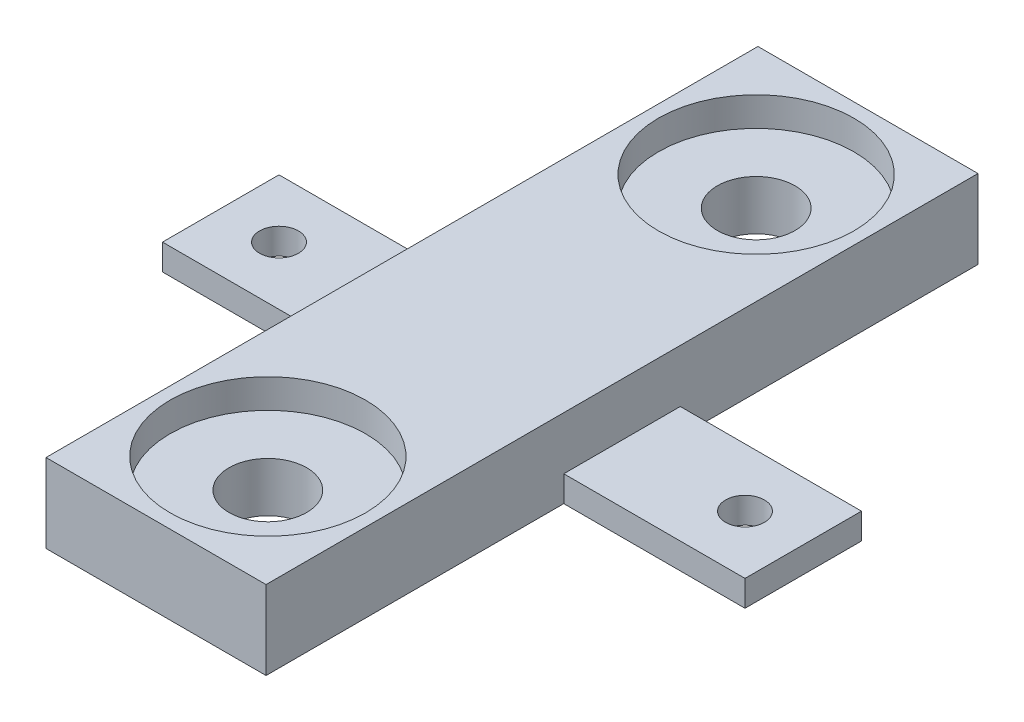
ISO-10303-21;
HEADER;
FILE_DESCRIPTION(('STEP AP214'),'2;1');
FILE_NAME('part.step','',(''),(''),'','','');
FILE_SCHEMA(('AUTOMOTIVE_DESIGN { 1 0 10303 214 1 1 1 1 }'));
ENDSEC;
DATA;
#1=APPLICATION_CONTEXT('core data for automotive mechanical design processes');
#2=APPLICATION_PROTOCOL_DEFINITION('international standard','automotive_design',2000,#1);
#3=PRODUCT_CONTEXT('',#1,'mechanical');
#4=PRODUCT('Part','Part','',(#3));
#5=PRODUCT_RELATED_PRODUCT_CATEGORY('part','',(#4));
#6=PRODUCT_DEFINITION_FORMATION('','',#4);
#7=PRODUCT_DEFINITION_CONTEXT('part definition',#1,'design');
#8=PRODUCT_DEFINITION('design','',#6,#7);
#9=PRODUCT_DEFINITION_SHAPE('','',#8);
#10=(LENGTH_UNIT() NAMED_UNIT(*) SI_UNIT(.MILLI.,.METRE.));
#11=(NAMED_UNIT(*) PLANE_ANGLE_UNIT() SI_UNIT($,.RADIAN.));
#12=(NAMED_UNIT(*) SI_UNIT($,.STERADIAN.) SOLID_ANGLE_UNIT());
#13=UNCERTAINTY_MEASURE_WITH_UNIT(LENGTH_MEASURE(1.E-05),#10,'distance_accuracy_value','');
#14=(GEOMETRIC_REPRESENTATION_CONTEXT(3) GLOBAL_UNCERTAINTY_ASSIGNED_CONTEXT((#13)) GLOBAL_UNIT_ASSIGNED_CONTEXT((#10,
#11,#12)) REPRESENTATION_CONTEXT('',''));
#15=CARTESIAN_POINT('',(0.,0.,0.));
#16=DIRECTION('',(0.,0.,1.));
#17=DIRECTION('',(1.,0.,0.));
#18=AXIS2_PLACEMENT_3D('',#15,#16,#17);
#19=CARTESIAN_POINT('',(0.,2.,0.));
#20=DIRECTION('',(0.,1.,0.));
#21=DIRECTION('',(0.,0.,1.));
#22=AXIS2_PLACEMENT_3D('',#19,#20,#21);
#23=PLANE('',#22);
#24=CARTESIAN_POINT('',(-18.,2.,0.));
#25=DIRECTION('',(0.,1.,0.));
#26=DIRECTION('',(0.,0.,1.));
#27=AXIS2_PLACEMENT_3D('',#24,#25,#26);
#28=CIRCLE('',#27,1.5);
#29=CARTESIAN_POINT('',(-18.,2.,1.5));
#30=VERTEX_POINT('',#29);
#31=EDGE_CURVE('E169',#30,#30,#28,.T.);
#32=ORIENTED_EDGE('',*,*,#31,.F.);
#33=EDGE_LOOP('',(#32));
#34=FACE_BOUND('',#33,.T.);
#35=DIRECTION('',(-1.,0.,0.));
#36=VECTOR('',#35,1.);
#37=CARTESIAN_POINT('',(0.,2.,4.49999999999999));
#38=LINE('',#37,#36);
#39=CARTESIAN_POINT('',(-8.5,2.,4.5));
#40=VERTEX_POINT('',#39);
#41=CARTESIAN_POINT('',(-22.5,2.,4.5));
#42=VERTEX_POINT('',#41);
#43=EDGE_CURVE('E155',#40,#42,#38,.T.);
#44=ORIENTED_EDGE('',*,*,#43,.F.);
#45=DIRECTION('',(0.,0.,-1.));
#46=VECTOR('',#45,1.);
#47=CARTESIAN_POINT('',(-8.5,2.,0.));
#48=LINE('',#47,#46);
#49=CARTESIAN_POINT('',(-8.5,2.,-4.5));
#50=VERTEX_POINT('',#49);
#51=EDGE_CURVE('E255',#40,#50,#48,.T.);
#52=ORIENTED_EDGE('',*,*,#51,.T.);
#53=DIRECTION('',(-1.,0.,0.));
#54=VECTOR('',#53,1.);
#55=CARTESIAN_POINT('',(0.,2.,-4.49999999999999));
#56=LINE('',#55,#54);
#57=CARTESIAN_POINT('',(-22.5,2.,-4.5));
#58=VERTEX_POINT('',#57);
#59=EDGE_CURVE('E138',#50,#58,#56,.T.);
#60=ORIENTED_EDGE('',*,*,#59,.T.);
#61=DIRECTION('',(0.,0.,1.));
#62=VECTOR('',#61,1.);
#63=CARTESIAN_POINT('',(-22.5,2.,0.));
#64=LINE('',#63,#62);
#65=EDGE_CURVE('E269',#58,#42,#64,.T.);
#66=ORIENTED_EDGE('',*,*,#65,.T.);
#67=EDGE_LOOP('',(#44,#52,#60,#66));
#68=FACE_BOUND('',#67,.T.);
#69=ADVANCED_FACE('F64',(#34,#68),#23,.T.);
#70=CARTESIAN_POINT('',(0.,2.,-27.5));
#71=DIRECTION('',(0.,0.,-1.));
#72=DIRECTION('',(-1.,0.,0.));
#73=AXIS2_PLACEMENT_3D('',#70,#71,#72);
#74=PLANE('',#73);
#75=DIRECTION('',(1.,0.,0.));
#76=VECTOR('',#75,1.);
#77=CARTESIAN_POINT('',(0.,0.,-27.5));
#78=LINE('',#77,#76);
#79=CARTESIAN_POINT('',(-8.5,0.,-27.5));
#80=VERTEX_POINT('',#79);
#81=CARTESIAN_POINT('',(8.5,0.,-27.5));
#82=VERTEX_POINT('',#81);
#83=EDGE_CURVE('E180',#80,#82,#78,.T.);
#84=ORIENTED_EDGE('',*,*,#83,.F.);
#85=DIRECTION('',(0.,-1.,0.));
#86=VECTOR('',#85,1.);
#87=CARTESIAN_POINT('',(-8.5,2.,-27.5));
#88=LINE('',#87,#86);
#89=CARTESIAN_POINT('',(-8.5,6.088,-27.5));
#90=VERTEX_POINT('',#89);
#91=EDGE_CURVE('E229',#90,#80,#88,.T.);
#92=ORIENTED_EDGE('',*,*,#91,.F.);
#93=DIRECTION('',(1.,0.,0.));
#94=VECTOR('',#93,1.);
#95=CARTESIAN_POINT('',(0.,6.088,-27.5));
#96=LINE('',#95,#94);
#97=CARTESIAN_POINT('',(8.5,6.088,-27.5));
#98=VERTEX_POINT('',#97);
#99=EDGE_CURVE('E261',#90,#98,#96,.T.);
#100=ORIENTED_EDGE('',*,*,#99,.T.);
#101=DIRECTION('',(0.,-1.,0.));
#102=VECTOR('',#101,1.);
#103=CARTESIAN_POINT('',(8.5,2.,-27.5));
#104=LINE('',#103,#102);
#105=EDGE_CURVE('E231',#98,#82,#104,.T.);
#106=ORIENTED_EDGE('',*,*,#105,.T.);
#107=EDGE_LOOP('',(#84,#92,#100,#106));
#108=FACE_BOUND('',#107,.T.);
#109=ADVANCED_FACE('F66',(#108),#74,.T.);
#110=CARTESIAN_POINT('',(0.,2.,-4.49999999999999));
#111=DIRECTION('',(0.,0.,1.));
#112=DIRECTION('',(1.,0.,0.));
#113=AXIS2_PLACEMENT_3D('',#110,#111,#112);
#114=PLANE('',#113);
#115=DIRECTION('',(-1.,0.,0.));
#116=VECTOR('',#115,1.);
#117=CARTESIAN_POINT('',(0.,0.,-4.49999999999999));
#118=LINE('',#117,#116);
#119=CARTESIAN_POINT('',(-8.5,0.,-4.5));
#120=VERTEX_POINT('',#119);
#121=CARTESIAN_POINT('',(-22.5,0.,-4.5));
#122=VERTEX_POINT('',#121);
#123=EDGE_CURVE('E187',#120,#122,#118,.T.);
#124=ORIENTED_EDGE('',*,*,#123,.T.);
#125=DIRECTION('',(0.,-1.,0.));
#126=VECTOR('',#125,1.);
#127=CARTESIAN_POINT('',(-22.5,2.,-4.5));
#128=LINE('',#127,#126);
#129=EDGE_CURVE('E223',#58,#122,#128,.T.);
#130=ORIENTED_EDGE('',*,*,#129,.F.);
#131=ORIENTED_EDGE('',*,*,#59,.F.);
#132=DIRECTION('',(0.,-1.,0.));
#133=VECTOR('',#132,1.);
#134=CARTESIAN_POINT('',(-8.5,2.,-4.5));
#135=LINE('',#134,#133);
#136=EDGE_CURVE('E226',#50,#120,#135,.T.);
#137=ORIENTED_EDGE('',*,*,#136,.T.);
#138=EDGE_LOOP('',(#124,#130,#131,#137));
#139=FACE_BOUND('',#138,.T.);
#140=ADVANCED_FACE('F336',(#139),#114,.F.);
#141=CARTESIAN_POINT('',(-22.5,2.,0.));
#142=DIRECTION('',(1.,0.,0.));
#143=DIRECTION('',(0.,0.,-1.));
#144=AXIS2_PLACEMENT_3D('',#141,#142,#143);
#145=PLANE('',#144);
#146=DIRECTION('',(0.,0.,1.));
#147=VECTOR('',#146,1.);
#148=CARTESIAN_POINT('',(-22.5,0.,0.));
#149=LINE('',#148,#147);
#150=CARTESIAN_POINT('',(-22.5,0.,4.5));
#151=VERTEX_POINT('',#150);
#152=EDGE_CURVE('E190',#122,#151,#149,.T.);
#153=ORIENTED_EDGE('',*,*,#152,.T.);
#154=DIRECTION('',(0.,-1.,0.));
#155=VECTOR('',#154,1.);
#156=CARTESIAN_POINT('',(-22.5,2.,4.5));
#157=LINE('',#156,#155);
#158=EDGE_CURVE('E221',#42,#151,#157,.T.);
#159=ORIENTED_EDGE('',*,*,#158,.F.);
#160=ORIENTED_EDGE('',*,*,#65,.F.);
#161=ORIENTED_EDGE('',*,*,#129,.T.);
#162=EDGE_LOOP('',(#153,#159,#160,#161));
#163=FACE_BOUND('',#162,.T.);
#164=ADVANCED_FACE('F490',(#163),#145,.F.);
#165=CARTESIAN_POINT('',(0.,2.,4.49999999999999));
#166=DIRECTION('',(0.,0.,1.));
#167=DIRECTION('',(1.,0.,0.));
#168=AXIS2_PLACEMENT_3D('',#165,#166,#167);
#169=PLANE('',#168);
#170=DIRECTION('',(-1.,0.,0.));
#171=VECTOR('',#170,1.);
#172=CARTESIAN_POINT('',(0.,0.,4.49999999999999));
#173=LINE('',#172,#171);
#174=CARTESIAN_POINT('',(-8.5,0.,4.49999999999999));
#175=VERTEX_POINT('',#174);
#176=EDGE_CURVE('E193',#175,#151,#173,.T.);
#177=ORIENTED_EDGE('',*,*,#176,.F.);
#178=DIRECTION('',(0.,-1.,0.));
#179=VECTOR('',#178,1.);
#180=CARTESIAN_POINT('',(-8.5,2.,4.49999999999999));
#181=LINE('',#180,#179);
#182=EDGE_CURVE('E219',#40,#175,#181,.T.);
#183=ORIENTED_EDGE('',*,*,#182,.F.);
#184=ORIENTED_EDGE('',*,*,#43,.T.);
#185=ORIENTED_EDGE('',*,*,#158,.T.);
#186=EDGE_LOOP('',(#177,#183,#184,#185));
#187=FACE_BOUND('',#186,.T.);
#188=ADVANCED_FACE('F275',(#187),#169,.T.);
#189=CARTESIAN_POINT('',(-8.5,2.,0.));
#190=DIRECTION('',(1.,0.,0.));
#191=DIRECTION('',(0.,0.,-1.));
#192=AXIS2_PLACEMENT_3D('',#189,#190,#191);
#193=PLANE('',#192);
#194=DIRECTION('',(0.,0.,1.));
#195=VECTOR('',#194,1.);
#196=CARTESIAN_POINT('',(-8.5,0.,0.));
#197=LINE('',#196,#195);
#198=CARTESIAN_POINT('',(-8.49999999999999,0.,27.5));
#199=VERTEX_POINT('',#198);
#200=EDGE_CURVE('E188',#175,#199,#197,.T.);
#201=ORIENTED_EDGE('',*,*,#200,.T.);
#202=DIRECTION('',(0.,-1.,0.));
#203=VECTOR('',#202,1.);
#204=CARTESIAN_POINT('',(-8.49999999999999,2.,27.5));
#205=LINE('',#204,#203);
#206=CARTESIAN_POINT('',(-8.49999999999999,6.088,27.5));
#207=VERTEX_POINT('',#206);
#208=EDGE_CURVE('E216',#207,#199,#205,.T.);
#209=ORIENTED_EDGE('',*,*,#208,.F.);
#210=DIRECTION('',(0.,0.,1.));
#211=VECTOR('',#210,1.);
#212=CARTESIAN_POINT('',(-8.5,6.088,0.));
#213=LINE('',#212,#211);
#214=EDGE_CURVE('E181',#90,#207,#213,.T.);
#215=ORIENTED_EDGE('',*,*,#214,.F.);
#216=ORIENTED_EDGE('',*,*,#91,.T.);
#217=EDGE_CURVE('E185',#80,#120,#197,.T.);
#218=ORIENTED_EDGE('',*,*,#217,.T.);
#219=ORIENTED_EDGE('',*,*,#136,.F.);
#220=ORIENTED_EDGE('',*,*,#51,.F.);
#221=ORIENTED_EDGE('',*,*,#182,.T.);
#222=EDGE_LOOP('',(#201,#209,#215,#216,#218,#219,#220,#221));
#223=FACE_BOUND('',#222,.T.);
#224=ADVANCED_FACE('F311',(#223),#193,.F.);
#225=CARTESIAN_POINT('',(0.,2.,27.5));
#226=DIRECTION('',(0.,0.,-1.));
#227=DIRECTION('',(-1.,0.,0.));
#228=AXIS2_PLACEMENT_3D('',#225,#226,#227);
#229=PLANE('',#228);
#230=DIRECTION('',(1.,0.,0.));
#231=VECTOR('',#230,1.);
#232=CARTESIAN_POINT('',(0.,0.,27.5));
#233=LINE('',#232,#231);
#234=CARTESIAN_POINT('',(8.5,0.,27.5));
#235=VERTEX_POINT('',#234);
#236=EDGE_CURVE('E196',#199,#235,#233,.T.);
#237=ORIENTED_EDGE('',*,*,#236,.T.);
#238=DIRECTION('',(0.,-1.,0.));
#239=VECTOR('',#238,1.);
#240=CARTESIAN_POINT('',(8.5,2.,27.5));
#241=LINE('',#240,#239);
#242=CARTESIAN_POINT('',(8.5,6.088,27.5));
#243=VERTEX_POINT('',#242);
#244=EDGE_CURVE('E214',#243,#235,#241,.T.);
#245=ORIENTED_EDGE('',*,*,#244,.F.);
#246=DIRECTION('',(1.,0.,0.));
#247=VECTOR('',#246,1.);
#248=CARTESIAN_POINT('',(0.,6.088,27.5));
#249=LINE('',#248,#247);
#250=EDGE_CURVE('E252',#207,#243,#249,.T.);
#251=ORIENTED_EDGE('',*,*,#250,.F.);
#252=ORIENTED_EDGE('',*,*,#208,.T.);
#253=EDGE_LOOP('',(#237,#245,#251,#252));
#254=FACE_BOUND('',#253,.T.);
#255=ADVANCED_FACE('F298',(#254),#229,.F.);
#256=CARTESIAN_POINT('',(8.5,2.,0.));
#257=DIRECTION('',(1.,0.,0.));
#258=DIRECTION('',(0.,0.,-1.));
#259=AXIS2_PLACEMENT_3D('',#256,#257,#258);
#260=PLANE('',#259);
#261=DIRECTION('',(0.,0.,1.));
#262=VECTOR('',#261,1.);
#263=CARTESIAN_POINT('',(8.5,0.,0.));
#264=LINE('',#263,#262);
#265=CARTESIAN_POINT('',(8.5,0.,4.5));
#266=VERTEX_POINT('',#265);
#267=EDGE_CURVE('E182',#266,#235,#264,.T.);
#268=ORIENTED_EDGE('',*,*,#267,.F.);
#269=DIRECTION('',(0.,-1.,0.));
#270=VECTOR('',#269,1.);
#271=CARTESIAN_POINT('',(8.5,2.,4.5));
#272=LINE('',#271,#270);
#273=CARTESIAN_POINT('',(8.5,2.,4.49999999999999));
#274=VERTEX_POINT('',#273);
#275=EDGE_CURVE('E164',#274,#266,#272,.T.);
#276=ORIENTED_EDGE('',*,*,#275,.F.);
#277=DIRECTION('',(0.,0.,-1.));
#278=VECTOR('',#277,1.);
#279=CARTESIAN_POINT('',(8.5,2.,0.));
#280=LINE('',#279,#278);
#281=CARTESIAN_POINT('',(8.5,2.,-4.5));
#282=VERTEX_POINT('',#281);
#283=EDGE_CURVE('E83',#274,#282,#280,.T.);
#284=ORIENTED_EDGE('',*,*,#283,.T.);
#285=DIRECTION('',(0.,-1.,0.));
#286=VECTOR('',#285,1.);
#287=CARTESIAN_POINT('',(8.5,2.,-4.5));
#288=LINE('',#287,#286);
#289=CARTESIAN_POINT('',(8.5,0.,-4.5));
#290=VERTEX_POINT('',#289);
#291=EDGE_CURVE('E129',#282,#290,#288,.T.);
#292=ORIENTED_EDGE('',*,*,#291,.T.);
#293=EDGE_CURVE('E178',#82,#290,#264,.T.);
#294=ORIENTED_EDGE('',*,*,#293,.F.);
#295=ORIENTED_EDGE('',*,*,#105,.F.);
#296=DIRECTION('',(0.,0.,1.));
#297=VECTOR('',#296,1.);
#298=CARTESIAN_POINT('',(8.5,6.088,0.));
#299=LINE('',#298,#297);
#300=EDGE_CURVE('E258',#98,#243,#299,.T.);
#301=ORIENTED_EDGE('',*,*,#300,.T.);
#302=ORIENTED_EDGE('',*,*,#244,.T.);
#303=EDGE_LOOP('',(#268,#276,#284,#292,#294,#295,#301,#302));
#304=FACE_BOUND('',#303,.T.);
#305=ADVANCED_FACE('F307',(#304),#260,.T.);
#306=CARTESIAN_POINT('',(0.,2.,4.5));
#307=DIRECTION('',(0.,0.,-1.));
#308=DIRECTION('',(-1.,0.,0.));
#309=AXIS2_PLACEMENT_3D('',#306,#307,#308);
#310=PLANE('',#309);
#311=DIRECTION('',(1.,0.,0.));
#312=VECTOR('',#311,1.);
#313=CARTESIAN_POINT('',(0.,0.,4.5));
#314=LINE('',#313,#312);
#315=CARTESIAN_POINT('',(22.5,0.,4.49999999999999));
#316=VERTEX_POINT('',#315);
#317=EDGE_CURVE('E161',#266,#316,#314,.T.);
#318=ORIENTED_EDGE('',*,*,#317,.T.);
#319=DIRECTION('',(0.,-1.,0.));
#320=VECTOR('',#319,1.);
#321=CARTESIAN_POINT('',(22.5,2.,4.49999999999999));
#322=LINE('',#321,#320);
#323=CARTESIAN_POINT('',(22.5,2.,4.49999999999999));
#324=VERTEX_POINT('',#323);
#325=EDGE_CURVE('E158',#324,#316,#322,.T.);
#326=ORIENTED_EDGE('',*,*,#325,.F.);
#327=DIRECTION('',(1.,0.,0.));
#328=VECTOR('',#327,1.);
#329=CARTESIAN_POINT('',(0.,2.,4.5));
#330=LINE('',#329,#328);
#331=EDGE_CURVE('E147',#274,#324,#330,.T.);
#332=ORIENTED_EDGE('',*,*,#331,.F.);
#333=ORIENTED_EDGE('',*,*,#275,.T.);
#334=EDGE_LOOP('',(#318,#326,#332,#333));
#335=FACE_BOUND('',#334,.T.);
#336=ADVANCED_FACE('F159',(#335),#310,.F.);
#337=CARTESIAN_POINT('',(22.5,2.,0.));
#338=DIRECTION('',(1.,0.,0.));
#339=DIRECTION('',(0.,0.,-1.));
#340=AXIS2_PLACEMENT_3D('',#337,#338,#339);
#341=PLANE('',#340);
#342=DIRECTION('',(0.,0.,1.));
#343=VECTOR('',#342,1.);
#344=CARTESIAN_POINT('',(22.5,0.,0.));
#345=LINE('',#344,#343);
#346=CARTESIAN_POINT('',(22.5,0.,-4.50000000000001));
#347=VERTEX_POINT('',#346);
#348=EDGE_CURVE('E200',#347,#316,#345,.T.);
#349=ORIENTED_EDGE('',*,*,#348,.F.);
#350=DIRECTION('',(0.,-1.,0.));
#351=VECTOR('',#350,1.);
#352=CARTESIAN_POINT('',(22.5,2.,-4.50000000000001));
#353=LINE('',#352,#351);
#354=CARTESIAN_POINT('',(22.5,2.,-4.50000000000001));
#355=VERTEX_POINT('',#354);
#356=EDGE_CURVE('E125',#355,#347,#353,.T.);
#357=ORIENTED_EDGE('',*,*,#356,.F.);
#358=DIRECTION('',(0.,0.,1.));
#359=VECTOR('',#358,1.);
#360=CARTESIAN_POINT('',(22.5,2.,0.));
#361=LINE('',#360,#359);
#362=EDGE_CURVE('E153',#355,#324,#361,.T.);
#363=ORIENTED_EDGE('',*,*,#362,.T.);
#364=ORIENTED_EDGE('',*,*,#325,.T.);
#365=EDGE_LOOP('',(#349,#357,#363,#364));
#366=FACE_BOUND('',#365,.T.);
#367=ADVANCED_FACE('F166',(#366),#341,.T.);
#368=CARTESIAN_POINT('',(-18.,2.,0.));
#369=DIRECTION('',(0.,-1.,0.));
#370=DIRECTION('',(0.,0.,-1.));
#371=AXIS2_PLACEMENT_3D('',#368,#369,#370);
#372=CYLINDRICAL_SURFACE('',#371,1.5);
#373=ORIENTED_EDGE('',*,*,#31,.T.);
#374=EDGE_LOOP('',(#373));
#375=FACE_BOUND('',#374,.T.);
#376=CARTESIAN_POINT('',(-18.,0.,0.));
#377=DIRECTION('',(0.,1.,0.));
#378=DIRECTION('',(0.,0.,1.));
#379=AXIS2_PLACEMENT_3D('',#376,#377,#378);
#380=CIRCLE('',#379,1.5);
#381=CARTESIAN_POINT('',(-18.,0.,1.5));
#382=VERTEX_POINT('',#381);
#383=EDGE_CURVE('E205',#382,#382,#380,.T.);
#384=ORIENTED_EDGE('',*,*,#383,.F.);
#385=EDGE_LOOP('',(#384));
#386=FACE_BOUND('',#385,.T.);
#387=ADVANCED_FACE('F319',(#375,#386),#372,.F.);
#388=CARTESIAN_POINT('',(0.,2.,-4.49999999999999));
#389=DIRECTION('',(0.,0.,-1.));
#390=DIRECTION('',(-1.,0.,0.));
#391=AXIS2_PLACEMENT_3D('',#388,#389,#390);
#392=PLANE('',#391);
#393=DIRECTION('',(1.,0.,0.));
#394=VECTOR('',#393,1.);
#395=CARTESIAN_POINT('',(0.,0.,-4.49999999999999));
#396=LINE('',#395,#394);
#397=EDGE_CURVE('E202',#290,#347,#396,.T.);
#398=ORIENTED_EDGE('',*,*,#397,.F.);
#399=ORIENTED_EDGE('',*,*,#291,.F.);
#400=DIRECTION('',(1.,0.,0.));
#401=VECTOR('',#400,1.);
#402=CARTESIAN_POINT('',(0.,2.,-4.49999999999999));
#403=LINE('',#402,#401);
#404=EDGE_CURVE('E167',#282,#355,#403,.T.);
#405=ORIENTED_EDGE('',*,*,#404,.T.);
#406=ORIENTED_EDGE('',*,*,#356,.T.);
#407=EDGE_LOOP('',(#398,#399,#405,#406));
#408=FACE_BOUND('',#407,.T.);
#409=ADVANCED_FACE('F316',(#408),#392,.T.);
#410=CARTESIAN_POINT('',(18.,2.,0.));
#411=DIRECTION('',(0.,-1.,0.));
#412=DIRECTION('',(0.,0.,-1.));
#413=AXIS2_PLACEMENT_3D('',#410,#411,#412);
#414=CYLINDRICAL_SURFACE('',#413,1.5);
#415=CARTESIAN_POINT('',(18.,2.,0.));
#416=DIRECTION('',(0.,1.,0.));
#417=DIRECTION('',(0.,0.,1.));
#418=AXIS2_PLACEMENT_3D('',#415,#416,#417);
#419=CIRCLE('',#418,1.5);
#420=CARTESIAN_POINT('',(18.,2.,1.49999999999999));
#421=VERTEX_POINT('',#420);
#422=EDGE_CURVE('E175',#421,#421,#419,.T.);
#423=ORIENTED_EDGE('',*,*,#422,.T.);
#424=EDGE_LOOP('',(#423));
#425=FACE_BOUND('',#424,.T.);
#426=CARTESIAN_POINT('',(18.,0.,0.));
#427=DIRECTION('',(0.,1.,0.));
#428=DIRECTION('',(0.,0.,1.));
#429=AXIS2_PLACEMENT_3D('',#426,#427,#428);
#430=CIRCLE('',#429,1.5);
#431=CARTESIAN_POINT('',(18.,0.,1.49999999999999));
#432=VERTEX_POINT('',#431);
#433=EDGE_CURVE('E208',#432,#432,#430,.T.);
#434=ORIENTED_EDGE('',*,*,#433,.F.);
#435=EDGE_LOOP('',(#434));
#436=FACE_BOUND('',#435,.T.);
#437=ADVANCED_FACE('F318',(#425,#436),#414,.F.);
#438=ORIENTED_EDGE('',*,*,#283,.F.);
#439=ORIENTED_EDGE('',*,*,#331,.T.);
#440=ORIENTED_EDGE('',*,*,#362,.F.);
#441=ORIENTED_EDGE('',*,*,#404,.F.);
#442=EDGE_LOOP('',(#438,#439,#440,#441));
#443=FACE_BOUND('',#442,.T.);
#444=ORIENTED_EDGE('',*,*,#422,.F.);
#445=EDGE_LOOP('',(#444));
#446=FACE_BOUND('',#445,.T.);
#447=ADVANCED_FACE('F149',(#443,#446),#23,.T.);
#448=CARTESIAN_POINT('',(0.,0.,0.));
#449=DIRECTION('',(0.,1.,0.));
#450=DIRECTION('',(0.,0.,1.));
#451=AXIS2_PLACEMENT_3D('',#448,#449,#450);
#452=PLANE('',#451);
#453=CARTESIAN_POINT('',(0.,0.,-18.8625));
#454=DIRECTION('',(0.,-1.,0.));
#455=DIRECTION('',(0.,0.,-1.));
#456=AXIS2_PLACEMENT_3D('',#453,#454,#455);
#457=CIRCLE('',#456,3.);
#458=CARTESIAN_POINT('',(0.,0.,-21.8625));
#459=VERTEX_POINT('',#458);
#460=EDGE_CURVE('E234',#459,#459,#457,.T.);
#461=ORIENTED_EDGE('',*,*,#460,.F.);
#462=EDGE_LOOP('',(#461));
#463=FACE_BOUND('',#462,.T.);
#464=CARTESIAN_POINT('',(0.,0.,18.8625));
#465=DIRECTION('',(0.,-1.,0.));
#466=DIRECTION('',(0.,0.,-1.));
#467=AXIS2_PLACEMENT_3D('',#464,#465,#466);
#468=CIRCLE('',#467,3.);
#469=CARTESIAN_POINT('',(0.,0.,15.8625));
#470=VERTEX_POINT('',#469);
#471=EDGE_CURVE('E240',#470,#470,#468,.T.);
#472=ORIENTED_EDGE('',*,*,#471,.F.);
#473=EDGE_LOOP('',(#472));
#474=FACE_BOUND('',#473,.T.);
#475=ORIENTED_EDGE('',*,*,#293,.T.);
#476=ORIENTED_EDGE('',*,*,#397,.T.);
#477=ORIENTED_EDGE('',*,*,#348,.T.);
#478=ORIENTED_EDGE('',*,*,#317,.F.);
#479=ORIENTED_EDGE('',*,*,#267,.T.);
#480=ORIENTED_EDGE('',*,*,#236,.F.);
#481=ORIENTED_EDGE('',*,*,#200,.F.);
#482=ORIENTED_EDGE('',*,*,#176,.T.);
#483=ORIENTED_EDGE('',*,*,#152,.F.);
#484=ORIENTED_EDGE('',*,*,#123,.F.);
#485=ORIENTED_EDGE('',*,*,#217,.F.);
#486=ORIENTED_EDGE('',*,*,#83,.T.);
#487=EDGE_LOOP('',(#475,#476,#477,#478,#479,#480,#481,#482,#483,#484,#485,#486));
#488=FACE_BOUND('',#487,.T.);
#489=ORIENTED_EDGE('',*,*,#383,.T.);
#490=EDGE_LOOP('',(#489));
#491=FACE_BOUND('',#490,.T.);
#492=ORIENTED_EDGE('',*,*,#433,.T.);
#493=EDGE_LOOP('',(#492));
#494=FACE_BOUND('',#493,.T.);
#495=ADVANCED_FACE('F314',(#463,#474,#488,#491,#494),#452,.F.);
#496=CARTESIAN_POINT('',(0.,6.088,0.));
#497=DIRECTION('',(0.,-1.,0.));
#498=DIRECTION('',(0.,0.,-1.));
#499=AXIS2_PLACEMENT_3D('',#496,#497,#498);
#500=PLANE('',#499);
#501=CARTESIAN_POINT('',(0.,6.088,18.8625));
#502=DIRECTION('',(0.,-1.,0.));
#503=DIRECTION('',(0.,0.,-1.));
#504=AXIS2_PLACEMENT_3D('',#501,#502,#503);
#505=CIRCLE('',#504,7.55);
#506=CARTESIAN_POINT('',(0.,6.088,11.3125));
#507=VERTEX_POINT('',#506);
#508=EDGE_CURVE('E238',#507,#507,#505,.T.);
#509=ORIENTED_EDGE('',*,*,#508,.T.);
#510=EDGE_LOOP('',(#509));
#511=FACE_BOUND('',#510,.T.);
#512=CARTESIAN_POINT('',(0.,6.088,-18.8625));
#513=DIRECTION('',(0.,-1.,0.));
#514=DIRECTION('',(0.,0.,-1.));
#515=AXIS2_PLACEMENT_3D('',#512,#513,#514);
#516=CIRCLE('',#515,7.55);
#517=CARTESIAN_POINT('',(0.,6.088,-26.4125));
#518=VERTEX_POINT('',#517);
#519=EDGE_CURVE('E248',#518,#518,#516,.T.);
#520=ORIENTED_EDGE('',*,*,#519,.T.);
#521=EDGE_LOOP('',(#520));
#522=FACE_BOUND('',#521,.T.);
#523=ORIENTED_EDGE('',*,*,#250,.T.);
#524=ORIENTED_EDGE('',*,*,#300,.F.);
#525=ORIENTED_EDGE('',*,*,#99,.F.);
#526=ORIENTED_EDGE('',*,*,#214,.T.);
#527=EDGE_LOOP('',(#523,#524,#525,#526));
#528=FACE_BOUND('',#527,.T.);
#529=ADVANCED_FACE('F304',(#511,#522,#528),#500,.F.);
#530=CARTESIAN_POINT('',(0.,6.088,-18.8625));
#531=DIRECTION('',(0.,-1.,0.));
#532=DIRECTION('',(0.,0.,-1.));
#533=AXIS2_PLACEMENT_3D('',#530,#531,#532);
#534=CYLINDRICAL_SURFACE('',#533,7.55);
#535=ORIENTED_EDGE('',*,*,#519,.F.);
#536=EDGE_LOOP('',(#535));
#537=FACE_BOUND('',#536,.T.);
#538=CARTESIAN_POINT('',(0.,3.838,-18.8625));
#539=DIRECTION('',(0.,-1.,0.));
#540=DIRECTION('',(0.,0.,-1.));
#541=AXIS2_PLACEMENT_3D('',#538,#539,#540);
#542=CIRCLE('',#541,7.55);
#543=CARTESIAN_POINT('',(0.,3.838,-26.4125));
#544=VERTEX_POINT('',#543);
#545=EDGE_CURVE('E74',#544,#544,#542,.T.);
#546=ORIENTED_EDGE('',*,*,#545,.T.);
#547=EDGE_LOOP('',(#546));
#548=FACE_BOUND('',#547,.T.);
#549=ADVANCED_FACE('F348',(#537,#548),#534,.F.);
#550=CARTESIAN_POINT('',(0.,6.088,18.8625));
#551=DIRECTION('',(0.,-1.,0.));
#552=DIRECTION('',(0.,0.,-1.));
#553=AXIS2_PLACEMENT_3D('',#550,#551,#552);
#554=CYLINDRICAL_SURFACE('',#553,7.55);
#555=ORIENTED_EDGE('',*,*,#508,.F.);
#556=EDGE_LOOP('',(#555));
#557=FACE_BOUND('',#556,.T.);
#558=CARTESIAN_POINT('',(0.,3.838,18.8625));
#559=DIRECTION('',(0.,-1.,0.));
#560=DIRECTION('',(0.,0.,-1.));
#561=AXIS2_PLACEMENT_3D('',#558,#559,#560);
#562=CIRCLE('',#561,7.55);
#563=CARTESIAN_POINT('',(0.,3.838,11.3125));
#564=VERTEX_POINT('',#563);
#565=EDGE_CURVE('E12',#564,#564,#562,.T.);
#566=ORIENTED_EDGE('',*,*,#565,.T.);
#567=EDGE_LOOP('',(#566));
#568=FACE_BOUND('',#567,.T.);
#569=ADVANCED_FACE('F367',(#557,#568),#554,.F.);
#570=CARTESIAN_POINT('',(0.,3.838,0.));
#571=DIRECTION('',(0.,-1.,0.));
#572=DIRECTION('',(0.,0.,-1.));
#573=AXIS2_PLACEMENT_3D('',#570,#571,#572);
#574=PLANE('',#573);
#575=CARTESIAN_POINT('',(0.,3.838,-18.8625));
#576=DIRECTION('',(0.,-1.,0.));
#577=DIRECTION('',(0.,0.,-1.));
#578=AXIS2_PLACEMENT_3D('',#575,#576,#577);
#579=CIRCLE('',#578,3.);
#580=CARTESIAN_POINT('',(0.,3.838,-21.8625));
#581=VERTEX_POINT('',#580);
#582=EDGE_CURVE('E68',#581,#581,#579,.T.);
#583=ORIENTED_EDGE('',*,*,#582,.T.);
#584=EDGE_LOOP('',(#583));
#585=FACE_BOUND('',#584,.T.);
#586=ORIENTED_EDGE('',*,*,#545,.F.);
#587=EDGE_LOOP('',(#586));
#588=FACE_BOUND('',#587,.T.);
#589=ADVANCED_FACE('F365',(#585,#588),#574,.F.);
#590=CARTESIAN_POINT('',(0.,3.838,18.8625));
#591=DIRECTION('',(0.,-1.,0.));
#592=DIRECTION('',(0.,0.,-1.));
#593=AXIS2_PLACEMENT_3D('',#590,#591,#592);
#594=CIRCLE('',#593,3.);
#595=CARTESIAN_POINT('',(0.,3.838,15.8625));
#596=VERTEX_POINT('',#595);
#597=EDGE_CURVE('E232',#596,#596,#594,.T.);
#598=ORIENTED_EDGE('',*,*,#597,.T.);
#599=EDGE_LOOP('',(#598));
#600=FACE_BOUND('',#599,.T.);
#601=ORIENTED_EDGE('',*,*,#565,.F.);
#602=EDGE_LOOP('',(#601));
#603=FACE_BOUND('',#602,.T.);
#604=ADVANCED_FACE('F358',(#600,#603),#574,.F.);
#605=CARTESIAN_POINT('',(0.,6.088,18.8625));
#606=DIRECTION('',(0.,-1.,0.));
#607=DIRECTION('',(0.,0.,-1.));
#608=AXIS2_PLACEMENT_3D('',#605,#606,#607);
#609=CYLINDRICAL_SURFACE('',#608,3.);
#610=ORIENTED_EDGE('',*,*,#471,.T.);
#611=EDGE_LOOP('',(#610));
#612=FACE_BOUND('',#611,.T.);
#613=ORIENTED_EDGE('',*,*,#597,.F.);
#614=EDGE_LOOP('',(#613));
#615=FACE_BOUND('',#614,.T.);
#616=ADVANCED_FACE('F354',(#612,#615),#609,.F.);
#617=CARTESIAN_POINT('',(0.,6.088,-18.8625));
#618=DIRECTION('',(0.,-1.,0.));
#619=DIRECTION('',(0.,0.,-1.));
#620=AXIS2_PLACEMENT_3D('',#617,#618,#619);
#621=CYLINDRICAL_SURFACE('',#620,3.);
#622=ORIENTED_EDGE('',*,*,#460,.T.);
#623=EDGE_LOOP('',(#622));
#624=FACE_BOUND('',#623,.T.);
#625=ORIENTED_EDGE('',*,*,#582,.F.);
#626=EDGE_LOOP('',(#625));
#627=FACE_BOUND('',#626,.T.);
#628=ADVANCED_FACE('F357',(#624,#627),#621,.F.);
#629=CLOSED_SHELL('',(#69,#109,#140,#164,#188,#224,#255,#305,#336,#367,#387,#409,#437,#447,#495,
#529,#549,#569,#589,#604,#616,#628));
#630=MANIFOLD_SOLID_BREP('B2',#629);
#631=ADVANCED_BREP_SHAPE_REPRESENTATION('',(#18,#630),#14);
#632=SHAPE_DEFINITION_REPRESENTATION(#9,#631);
ENDSEC;
END-ISO-10303-21;
